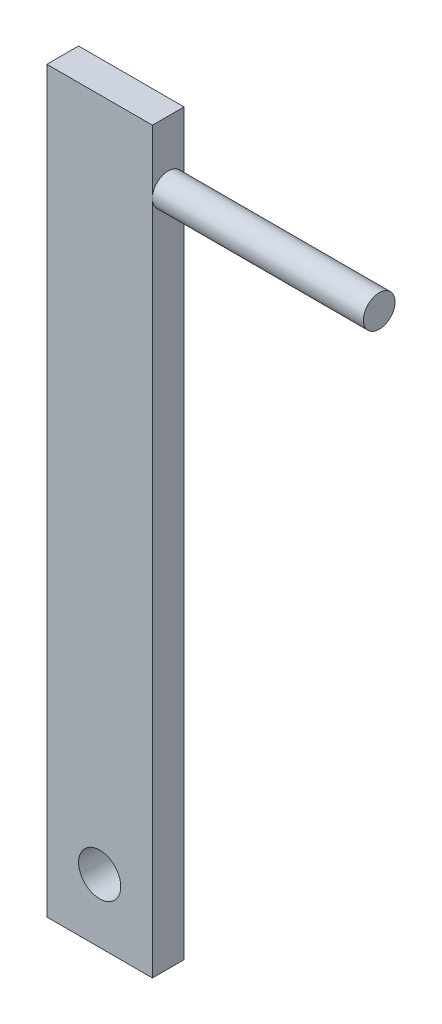
ISO-10303-21;
HEADER;
FILE_DESCRIPTION(('STEP AP214'),'2;1');
FILE_NAME('part.step','',(''),(''),'','','');
FILE_SCHEMA(('AUTOMOTIVE_DESIGN { 1 0 10303 214 1 1 1 1 }'));
ENDSEC;
DATA;
#1=APPLICATION_CONTEXT('core data for automotive mechanical design processes');
#2=APPLICATION_PROTOCOL_DEFINITION('international standard','automotive_design',2000,#1);
#3=PRODUCT_CONTEXT('',#1,'mechanical');
#4=PRODUCT('Part','Part','',(#3));
#5=PRODUCT_RELATED_PRODUCT_CATEGORY('part','',(#4));
#6=PRODUCT_DEFINITION_FORMATION('','',#4);
#7=PRODUCT_DEFINITION_CONTEXT('part definition',#1,'design');
#8=PRODUCT_DEFINITION('design','',#6,#7);
#9=PRODUCT_DEFINITION_SHAPE('','',#8);
#10=(LENGTH_UNIT() NAMED_UNIT(*) SI_UNIT(.MILLI.,.METRE.));
#11=(NAMED_UNIT(*) PLANE_ANGLE_UNIT() SI_UNIT($,.RADIAN.));
#12=(NAMED_UNIT(*) SI_UNIT($,.STERADIAN.) SOLID_ANGLE_UNIT());
#13=UNCERTAINTY_MEASURE_WITH_UNIT(LENGTH_MEASURE(1.E-05),#10,'distance_accuracy_value','');
#14=(GEOMETRIC_REPRESENTATION_CONTEXT(3) GLOBAL_UNCERTAINTY_ASSIGNED_CONTEXT((#13)) GLOBAL_UNIT_ASSIGNED_CONTEXT((#10,
#11,#12)) REPRESENTATION_CONTEXT('',''));
#15=CARTESIAN_POINT('',(0.,0.,0.));
#16=DIRECTION('',(0.,0.,1.));
#17=DIRECTION('',(1.,0.,0.));
#18=AXIS2_PLACEMENT_3D('',#15,#16,#17);
#19=CARTESIAN_POINT('',(5.,35.,0.));
#20=DIRECTION('',(-1.,0.,0.));
#21=DIRECTION('',(0.,0.,1.));
#22=AXIS2_PLACEMENT_3D('',#19,#20,#21);
#23=PLANE('',#22);
#24=CARTESIAN_POINT('',(5.,32.,0.75));
#25=DIRECTION('',(1.,0.,0.));
#26=DIRECTION('',(0.,0.,-1.));
#27=AXIS2_PLACEMENT_3D('',#24,#25,#26);
#28=CIRCLE('',#27,0.750000000000001);
#29=CARTESIAN_POINT('',(5.,32.,0.));
#30=VERTEX_POINT('',#29);
#31=CARTESIAN_POINT('',(5.,32.,1.5));
#32=VERTEX_POINT('',#31);
#33=EDGE_CURVE('E45',#30,#32,#28,.T.);
#34=ORIENTED_EDGE('',*,*,#33,.F.);
#35=DIRECTION('',(0.,-1.,0.));
#36=VECTOR('',#35,1.);
#37=CARTESIAN_POINT('',(5.,35.,0.));
#38=LINE('',#37,#36);
#39=CARTESIAN_POINT('',(5.,35.,0.));
#40=VERTEX_POINT('',#39);
#41=EDGE_CURVE('E90',#40,#30,#38,.T.);
#42=ORIENTED_EDGE('',*,*,#41,.F.);
#43=DIRECTION('',(0.,0.,-1.));
#44=VECTOR('',#43,1.);
#45=CARTESIAN_POINT('',(5.,35.,0.));
#46=LINE('',#45,#44);
#47=CARTESIAN_POINT('',(5.,35.,1.5));
#48=VERTEX_POINT('',#47);
#49=EDGE_CURVE('E160',#48,#40,#46,.T.);
#50=ORIENTED_EDGE('',*,*,#49,.F.);
#51=DIRECTION('',(0.,-1.,0.));
#52=VECTOR('',#51,1.);
#53=CARTESIAN_POINT('',(5.,35.,1.5));
#54=LINE('',#53,#52);
#55=EDGE_CURVE('E105',#48,#32,#54,.T.);
#56=ORIENTED_EDGE('',*,*,#55,.T.);
#57=EDGE_LOOP('',(#34,#42,#50,#56));
#58=FACE_BOUND('',#57,.T.);
#59=ADVANCED_FACE('F34',(#58),#23,.F.);
#60=CARTESIAN_POINT('',(0.,35.,0.));
#61=DIRECTION('',(1.,0.,0.));
#62=DIRECTION('',(0.,0.,-1.));
#63=AXIS2_PLACEMENT_3D('',#60,#61,#62);
#64=PLANE('',#63);
#65=DIRECTION('',(0.,0.,1.));
#66=VECTOR('',#65,1.);
#67=CARTESIAN_POINT('',(0.,0.,0.));
#68=LINE('',#67,#66);
#69=CARTESIAN_POINT('',(0.,0.,0.));
#70=VERTEX_POINT('',#69);
#71=CARTESIAN_POINT('',(0.,0.,1.5));
#72=VERTEX_POINT('',#71);
#73=EDGE_CURVE('E151',#70,#72,#68,.T.);
#74=ORIENTED_EDGE('',*,*,#73,.T.);
#75=DIRECTION('',(0.,-1.,0.));
#76=VECTOR('',#75,1.);
#77=CARTESIAN_POINT('',(0.,35.,1.5));
#78=LINE('',#77,#76);
#79=CARTESIAN_POINT('',(0.,35.,1.5));
#80=VERTEX_POINT('',#79);
#81=EDGE_CURVE('E43',#80,#72,#78,.T.);
#82=ORIENTED_EDGE('',*,*,#81,.F.);
#83=DIRECTION('',(0.,0.,1.));
#84=VECTOR('',#83,1.);
#85=CARTESIAN_POINT('',(0.,35.,0.));
#86=LINE('',#85,#84);
#87=CARTESIAN_POINT('',(0.,35.,0.));
#88=VERTEX_POINT('',#87);
#89=EDGE_CURVE('E154',#88,#80,#86,.T.);
#90=ORIENTED_EDGE('',*,*,#89,.F.);
#91=DIRECTION('',(0.,-1.,0.));
#92=VECTOR('',#91,1.);
#93=CARTESIAN_POINT('',(0.,35.,0.));
#94=LINE('',#93,#92);
#95=EDGE_CURVE('E102',#88,#70,#94,.T.);
#96=ORIENTED_EDGE('',*,*,#95,.T.);
#97=EDGE_LOOP('',(#74,#82,#90,#96));
#98=FACE_BOUND('',#97,.T.);
#99=ADVANCED_FACE('F36',(#98),#64,.F.);
#100=CARTESIAN_POINT('',(0.,35.,1.5));
#101=DIRECTION('',(0.,0.,-1.));
#102=DIRECTION('',(-1.,0.,0.));
#103=AXIS2_PLACEMENT_3D('',#100,#101,#102);
#104=PLANE('',#103);
#105=CARTESIAN_POINT('',(2.5,3.,1.5));
#106=DIRECTION('',(0.,0.,-1.));
#107=DIRECTION('',(-1.,0.,0.));
#108=AXIS2_PLACEMENT_3D('',#105,#106,#107);
#109=CIRCLE('',#108,1.);
#110=CARTESIAN_POINT('',(1.5,3.,1.5));
#111=VERTEX_POINT('',#110);
#112=EDGE_CURVE('E144',#111,#111,#109,.T.);
#113=ORIENTED_EDGE('',*,*,#112,.T.);
#114=EDGE_LOOP('',(#113));
#115=FACE_BOUND('',#114,.T.);
#116=DIRECTION('',(1.,0.,0.));
#117=VECTOR('',#116,1.);
#118=CARTESIAN_POINT('',(0.,0.,1.5));
#119=LINE('',#118,#117);
#120=CARTESIAN_POINT('',(5.,0.,1.5));
#121=VERTEX_POINT('',#120);
#122=EDGE_CURVE('E146',#72,#121,#119,.T.);
#123=ORIENTED_EDGE('',*,*,#122,.T.);
#124=EDGE_CURVE('E97',#32,#121,#54,.T.);
#125=ORIENTED_EDGE('',*,*,#124,.F.);
#126=ORIENTED_EDGE('',*,*,#55,.F.);
#127=DIRECTION('',(1.,0.,0.));
#128=VECTOR('',#127,1.);
#129=CARTESIAN_POINT('',(0.,35.,1.5));
#130=LINE('',#129,#128);
#131=EDGE_CURVE('E86',#80,#48,#130,.T.);
#132=ORIENTED_EDGE('',*,*,#131,.F.);
#133=ORIENTED_EDGE('',*,*,#81,.T.);
#134=EDGE_LOOP('',(#123,#125,#126,#132,#133));
#135=FACE_BOUND('',#134,.T.);
#136=ADVANCED_FACE('F129',(#115,#135),#104,.F.);
#137=EDGE_CURVE('E11',#32,#30,#28,.T.);
#138=ORIENTED_EDGE('',*,*,#137,.F.);
#139=ORIENTED_EDGE('',*,*,#124,.T.);
#140=DIRECTION('',(0.,0.,-1.));
#141=VECTOR('',#140,1.);
#142=CARTESIAN_POINT('',(5.,0.,0.));
#143=LINE('',#142,#141);
#144=CARTESIAN_POINT('',(5.,0.,0.));
#145=VERTEX_POINT('',#144);
#146=EDGE_CURVE('E101',#121,#145,#143,.T.);
#147=ORIENTED_EDGE('',*,*,#146,.T.);
#148=EDGE_CURVE('E92',#30,#145,#38,.T.);
#149=ORIENTED_EDGE('',*,*,#148,.F.);
#150=EDGE_LOOP('',(#138,#139,#147,#149));
#151=FACE_BOUND('',#150,.T.);
#152=ADVANCED_FACE('F99',(#151),#23,.F.);
#153=CARTESIAN_POINT('',(0.,35.,0.));
#154=DIRECTION('',(0.,0.,1.));
#155=DIRECTION('',(1.,0.,0.));
#156=AXIS2_PLACEMENT_3D('',#153,#154,#155);
#157=PLANE('',#156);
#158=CARTESIAN_POINT('',(2.5,3.,0.));
#159=DIRECTION('',(0.,0.,1.));
#160=DIRECTION('',(1.,0.,0.));
#161=AXIS2_PLACEMENT_3D('',#158,#159,#160);
#162=CIRCLE('',#161,1.);
#163=CARTESIAN_POINT('',(3.5,3.,0.));
#164=VERTEX_POINT('',#163);
#165=EDGE_CURVE('E38',#164,#164,#162,.T.);
#166=ORIENTED_EDGE('',*,*,#165,.T.);
#167=EDGE_LOOP('',(#166));
#168=FACE_BOUND('',#167,.T.);
#169=DIRECTION('',(-1.,0.,0.));
#170=VECTOR('',#169,1.);
#171=CARTESIAN_POINT('',(0.,0.,0.));
#172=LINE('',#171,#170);
#173=EDGE_CURVE('E78',#145,#70,#172,.T.);
#174=ORIENTED_EDGE('',*,*,#173,.T.);
#175=ORIENTED_EDGE('',*,*,#95,.F.);
#176=DIRECTION('',(-1.,0.,0.));
#177=VECTOR('',#176,1.);
#178=CARTESIAN_POINT('',(0.,35.,0.));
#179=LINE('',#178,#177);
#180=EDGE_CURVE('E59',#40,#88,#179,.T.);
#181=ORIENTED_EDGE('',*,*,#180,.F.);
#182=ORIENTED_EDGE('',*,*,#41,.T.);
#183=ORIENTED_EDGE('',*,*,#148,.T.);
#184=EDGE_LOOP('',(#174,#175,#181,#182,#183));
#185=FACE_BOUND('',#184,.T.);
#186=ADVANCED_FACE('F91',(#168,#185),#157,.F.);
#187=CARTESIAN_POINT('',(0.,35.,0.));
#188=DIRECTION('',(0.,1.,0.));
#189=DIRECTION('',(0.,0.,1.));
#190=AXIS2_PLACEMENT_3D('',#187,#188,#189);
#191=PLANE('',#190);
#192=ORIENTED_EDGE('',*,*,#89,.T.);
#193=ORIENTED_EDGE('',*,*,#131,.T.);
#194=ORIENTED_EDGE('',*,*,#49,.T.);
#195=ORIENTED_EDGE('',*,*,#180,.T.);
#196=EDGE_LOOP('',(#192,#193,#194,#195));
#197=FACE_BOUND('',#196,.T.);
#198=ADVANCED_FACE('F137',(#197),#191,.T.);
#199=CARTESIAN_POINT('',(0.,0.,0.));
#200=DIRECTION('',(0.,1.,0.));
#201=DIRECTION('',(0.,0.,1.));
#202=AXIS2_PLACEMENT_3D('',#199,#200,#201);
#203=PLANE('',#202);
#204=ORIENTED_EDGE('',*,*,#73,.F.);
#205=ORIENTED_EDGE('',*,*,#173,.F.);
#206=ORIENTED_EDGE('',*,*,#146,.F.);
#207=ORIENTED_EDGE('',*,*,#122,.F.);
#208=EDGE_LOOP('',(#204,#205,#206,#207));
#209=FACE_BOUND('',#208,.T.);
#210=ADVANCED_FACE('F120',(#209),#203,.F.);
#211=CARTESIAN_POINT('',(2.5,3.,1.5));
#212=DIRECTION('',(0.,0.,-1.));
#213=DIRECTION('',(-1.,0.,0.));
#214=AXIS2_PLACEMENT_3D('',#211,#212,#213);
#215=CYLINDRICAL_SURFACE('',#214,1.);
#216=ORIENTED_EDGE('',*,*,#112,.F.);
#217=EDGE_LOOP('',(#216));
#218=FACE_BOUND('',#217,.T.);
#219=ORIENTED_EDGE('',*,*,#165,.F.);
#220=EDGE_LOOP('',(#219));
#221=FACE_BOUND('',#220,.T.);
#222=ADVANCED_FACE('F111',(#218,#221),#215,.F.);
#223=CARTESIAN_POINT('',(15.,32.,0.75));
#224=DIRECTION('',(-1.,0.,0.));
#225=DIRECTION('',(0.,0.,1.));
#226=AXIS2_PLACEMENT_3D('',#223,#224,#225);
#227=CYLINDRICAL_SURFACE('',#226,0.750000000000001);
#228=CARTESIAN_POINT('',(15.,32.,0.75));
#229=DIRECTION('',(1.,0.,0.));
#230=DIRECTION('',(0.,0.,-1.));
#231=AXIS2_PLACEMENT_3D('',#228,#229,#230);
#232=CIRCLE('',#231,0.750000000000001);
#233=CARTESIAN_POINT('',(15.,32.,0.));
#234=VERTEX_POINT('',#233);
#235=EDGE_CURVE('E107',#234,#234,#232,.T.);
#236=ORIENTED_EDGE('',*,*,#235,.F.);
#237=EDGE_LOOP('',(#236));
#238=FACE_BOUND('',#237,.T.);
#239=ORIENTED_EDGE('',*,*,#33,.T.);
#240=ORIENTED_EDGE('',*,*,#137,.T.);
#241=EDGE_LOOP('',(#239,#240));
#242=FACE_BOUND('',#241,.T.);
#243=ADVANCED_FACE('F108',(#238,#242),#227,.T.);
#244=CARTESIAN_POINT('',(15.,32.,0.75));
#245=DIRECTION('',(1.,0.,0.));
#246=DIRECTION('',(0.,0.,-1.));
#247=AXIS2_PLACEMENT_3D('',#244,#245,#246);
#248=PLANE('',#247);
#249=ORIENTED_EDGE('',*,*,#235,.T.);
#250=EDGE_LOOP('',(#249));
#251=FACE_BOUND('',#250,.T.);
#252=ADVANCED_FACE('F110',(#251),#248,.T.);
#253=CLOSED_SHELL('',(#59,#99,#136,#152,#186,#198,#210,#222,#243,#252));
#254=MANIFOLD_SOLID_BREP('B2',#253);
#255=ADVANCED_BREP_SHAPE_REPRESENTATION('',(#18,#254),#14);
#256=SHAPE_DEFINITION_REPRESENTATION(#9,#255);
ENDSEC;
END-ISO-10303-21;
